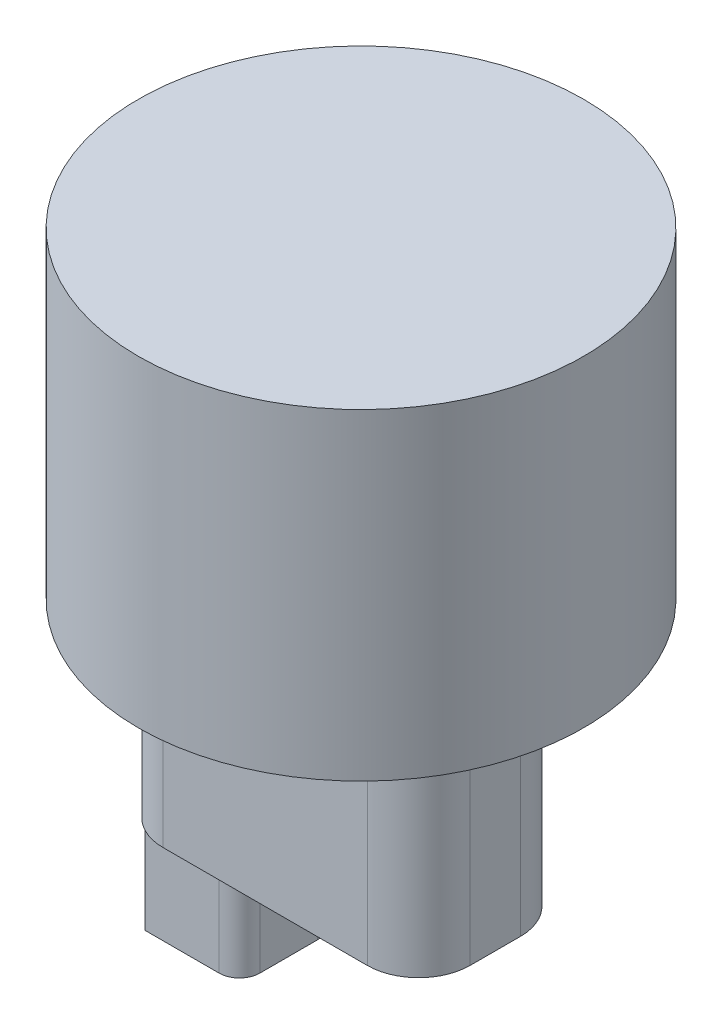
ISO-10303-21;
HEADER;
FILE_DESCRIPTION(('STEP AP214'),'2;1');
FILE_NAME('part.step','',(''),(''),'','','');
FILE_SCHEMA(('AUTOMOTIVE_DESIGN { 1 0 10303 214 1 1 1 1 }'));
ENDSEC;
DATA;
#1=APPLICATION_CONTEXT('core data for automotive mechanical design processes');
#2=APPLICATION_PROTOCOL_DEFINITION('international standard','automotive_design',2000,#1);
#3=PRODUCT_CONTEXT('',#1,'mechanical');
#4=PRODUCT('Part','Part','',(#3));
#5=PRODUCT_RELATED_PRODUCT_CATEGORY('part','',(#4));
#6=PRODUCT_DEFINITION_FORMATION('','',#4);
#7=PRODUCT_DEFINITION_CONTEXT('part definition',#1,'design');
#8=PRODUCT_DEFINITION('design','',#6,#7);
#9=PRODUCT_DEFINITION_SHAPE('','',#8);
#10=(LENGTH_UNIT() NAMED_UNIT(*) SI_UNIT(.MILLI.,.METRE.));
#11=(NAMED_UNIT(*) PLANE_ANGLE_UNIT() SI_UNIT($,.RADIAN.));
#12=(NAMED_UNIT(*) SI_UNIT($,.STERADIAN.) SOLID_ANGLE_UNIT());
#13=UNCERTAINTY_MEASURE_WITH_UNIT(LENGTH_MEASURE(1.E-05),#10,'distance_accuracy_value','');
#14=(GEOMETRIC_REPRESENTATION_CONTEXT(3) GLOBAL_UNCERTAINTY_ASSIGNED_CONTEXT((#13)) GLOBAL_UNIT_ASSIGNED_CONTEXT((#10,
#11,#12)) REPRESENTATION_CONTEXT('',''));
#15=CARTESIAN_POINT('',(0.,0.,0.));
#16=DIRECTION('',(0.,0.,1.));
#17=DIRECTION('',(1.,0.,0.));
#18=AXIS2_PLACEMENT_3D('',#15,#16,#17);
#19=CARTESIAN_POINT('',(-31.6,-61.8,-6.56885426065514));
#20=DIRECTION('',(0.,-1.,0.));
#21=DIRECTION('',(0.,0.,-1.));
#22=AXIS2_PLACEMENT_3D('',#19,#20,#21);
#23=PLANE('',#22);
#24=CARTESIAN_POINT('',(-31.6,-61.8,6.56885426065515));
#25=DIRECTION('',(0.,1.,0.));
#26=DIRECTION('',(0.,0.,-1.));
#27=AXIS2_PLACEMENT_3D('',#24,#25,#26);
#28=CIRCLE('',#27,13.4);
#29=CARTESIAN_POINT('',(-44.526368777329,-61.8,10.1));
#30=VERTEX_POINT('',#29);
#31=CARTESIAN_POINT('',(-43.4630865618963,-61.8,12.8));
#32=VERTEX_POINT('',#31);
#33=EDGE_CURVE('E225',#30,#32,#28,.T.);
#34=ORIENTED_EDGE('',*,*,#33,.F.);
#35=DIRECTION('',(0.366418867951286,0.,0.930450005754903));
#36=VECTOR('',#35,1.);
#37=CARTESIAN_POINT('',(-48.4738249382267,-61.8,0.076196836804784));
#38=LINE('',#37,#36);
#39=EDGE_CURVE('E11',#30,#32,#38,.T.);
#40=ORIENTED_EDGE('',*,*,#39,.T.);
#41=EDGE_LOOP('',(#34,#40));
#42=FACE_BOUND('',#41,.T.);
#43=ADVANCED_FACE('F39',(#42),#23,.T.);
#44=DIRECTION('',(1.,0.,0.));
#45=VECTOR('',#44,1.);
#46=CARTESIAN_POINT('',(-31.6,-61.8,10.1));
#47=LINE('',#46,#45);
#48=CARTESIAN_POINT('',(-24.2524934258124,-61.8,10.1));
#49=VERTEX_POINT('',#48);
#50=EDGE_CURVE('E48',#30,#49,#47,.T.);
#51=ORIENTED_EDGE('',*,*,#50,.F.);
#52=CARTESIAN_POINT('',(-45.,-61.8,6.56885426065507));
#53=VERTEX_POINT('',#52);
#54=EDGE_CURVE('E220',#53,#30,#28,.T.);
#55=ORIENTED_EDGE('',*,*,#54,.F.);
#56=DIRECTION('',(0.,0.,1.));
#57=VECTOR('',#56,1.);
#58=CARTESIAN_POINT('',(-45.,-61.8,6.56885426065507));
#59=LINE('',#58,#57);
#60=CARTESIAN_POINT('',(-45.,-61.8,-6.56885426065504));
#61=VERTEX_POINT('',#60);
#62=EDGE_CURVE('E213',#61,#53,#59,.T.);
#63=ORIENTED_EDGE('',*,*,#62,.F.);
#64=CARTESIAN_POINT('',(-31.6,-61.8,-6.56885426065514));
#65=DIRECTION('',(0.,1.,0.));
#66=DIRECTION('',(0.,0.,-1.));
#67=AXIS2_PLACEMENT_3D('',#64,#65,#66);
#68=CIRCLE('',#67,13.4);
#69=CARTESIAN_POINT('',(-44.526368777329,-61.8,-10.1));
#70=VERTEX_POINT('',#69);
#71=EDGE_CURVE('E215',#70,#61,#68,.T.);
#72=ORIENTED_EDGE('',*,*,#71,.F.);
#73=DIRECTION('',(1.,0.,0.));
#74=VECTOR('',#73,1.);
#75=CARTESIAN_POINT('',(-31.6,-61.8,-10.1));
#76=LINE('',#75,#74);
#77=CARTESIAN_POINT('',(-24.2524934258124,-61.8,-10.1));
#78=VERTEX_POINT('',#77);
#79=EDGE_CURVE('E323',#70,#78,#76,.T.);
#80=ORIENTED_EDGE('',*,*,#79,.T.);
#81=CARTESIAN_POINT('',(-24.2524934258124,-61.8,-7.39999999999999));
#82=DIRECTION('',(0.,-1.,0.));
#83=DIRECTION('',(0.,0.,-1.));
#84=AXIS2_PLACEMENT_3D('',#81,#82,#83);
#85=CIRCLE('',#84,2.7);
#86=CARTESIAN_POINT('',(-21.5524934258124,-61.8,-7.39999999999997));
#87=VERTEX_POINT('',#86);
#88=EDGE_CURVE('E327',#78,#87,#85,.T.);
#89=ORIENTED_EDGE('',*,*,#88,.T.);
#90=DIRECTION('',(0.,0.,1.));
#91=VECTOR('',#90,1.);
#92=CARTESIAN_POINT('',(-21.5524934258124,-61.8,-6.56885426065514));
#93=LINE('',#92,#91);
#94=CARTESIAN_POINT('',(-21.5524934258124,-61.8,7.39999999999998));
#95=VERTEX_POINT('',#94);
#96=EDGE_CURVE('E331',#87,#95,#93,.T.);
#97=ORIENTED_EDGE('',*,*,#96,.T.);
#98=CARTESIAN_POINT('',(-24.2524934258124,-61.8,7.4));
#99=DIRECTION('',(0.,-1.,0.));
#100=DIRECTION('',(0.,0.,-1.));
#101=AXIS2_PLACEMENT_3D('',#98,#99,#100);
#102=CIRCLE('',#101,2.7);
#103=EDGE_CURVE('E335',#49,#95,#102,.F.);
#104=ORIENTED_EDGE('',*,*,#103,.F.);
#105=EDGE_LOOP('',(#51,#55,#63,#72,#80,#89,#97,#104));
#106=FACE_BOUND('',#105,.T.);
#107=ADVANCED_FACE('F355',(#106),#23,.T.);
#108=DIRECTION('',(0.366418867951281,0.,-0.930450005754904));
#109=VECTOR('',#108,1.);
#110=CARTESIAN_POINT('',(-43.9947276696127,-61.8,-11.4499999999999));
#111=LINE('',#110,#109);
#112=CARTESIAN_POINT('',(-43.4630865618963,-61.8,-12.8));
#113=VERTEX_POINT('',#112);
#114=EDGE_CURVE('E320',#70,#113,#111,.T.);
#115=ORIENTED_EDGE('',*,*,#114,.F.);
#116=EDGE_CURVE('E214',#113,#70,#68,.T.);
#117=ORIENTED_EDGE('',*,*,#116,.F.);
#118=EDGE_LOOP('',(#115,#117));
#119=FACE_BOUND('',#118,.T.);
#120=ADVANCED_FACE('F506',(#119),#23,.T.);
#121=CARTESIAN_POINT('',(0.,83.82,0.));
#122=DIRECTION('',(0.,-1.,0.));
#123=DIRECTION('',(0.,0.,-1.));
#124=AXIS2_PLACEMENT_3D('',#121,#122,#123);
#125=CYLINDRICAL_SURFACE('',#124,58.);
#126=CARTESIAN_POINT('',(0.,83.82,0.));
#127=DIRECTION('',(0.,1.,0.));
#128=DIRECTION('',(0.,0.,1.));
#129=AXIS2_PLACEMENT_3D('',#126,#127,#128);
#130=CIRCLE('',#129,58.);
#131=CARTESIAN_POINT('',(0.,83.82,58.));
#132=VERTEX_POINT('',#131);
#133=EDGE_CURVE('E297',#132,#132,#130,.T.);
#134=ORIENTED_EDGE('',*,*,#133,.F.);
#135=EDGE_LOOP('',(#134));
#136=FACE_BOUND('',#135,.T.);
#137=CARTESIAN_POINT('',(0.,0.,0.));
#138=DIRECTION('',(0.,1.,0.));
#139=DIRECTION('',(0.,0.,1.));
#140=AXIS2_PLACEMENT_3D('',#137,#138,#139);
#141=CIRCLE('',#140,58.);
#142=CARTESIAN_POINT('',(0.,0.,58.));
#143=VERTEX_POINT('',#142);
#144=EDGE_CURVE('E275',#143,#143,#141,.T.);
#145=ORIENTED_EDGE('',*,*,#144,.T.);
#146=EDGE_LOOP('',(#145));
#147=FACE_BOUND('',#146,.T.);
#148=ADVANCED_FACE('F41',(#136,#147),#125,.T.);
#149=CARTESIAN_POINT('',(0.,83.82,0.));
#150=DIRECTION('',(0.,1.,0.));
#151=DIRECTION('',(0.,0.,1.));
#152=AXIS2_PLACEMENT_3D('',#149,#150,#151);
#153=PLANE('',#152);
#154=ORIENTED_EDGE('',*,*,#133,.T.);
#155=EDGE_LOOP('',(#154));
#156=FACE_BOUND('',#155,.T.);
#157=ADVANCED_FACE('F520',(#156),#153,.T.);
#158=CARTESIAN_POINT('',(0.,0.,0.));
#159=DIRECTION('',(0.,1.,0.));
#160=DIRECTION('',(0.,0.,1.));
#161=AXIS2_PLACEMENT_3D('',#158,#159,#160);
#162=PLANE('',#161);
#163=DIRECTION('',(-1.,0.,0.));
#164=VECTOR('',#163,1.);
#165=CARTESIAN_POINT('',(-31.5999999999999,0.,-19.9688542606551));
#166=LINE('',#165,#164);
#167=CARTESIAN_POINT('',(21.5999999999999,0.,-19.9688542606551));
#168=VERTEX_POINT('',#167);
#169=CARTESIAN_POINT('',(-31.5999999999999,0.,-19.9688542606551));
#170=VERTEX_POINT('',#169);
#171=EDGE_CURVE('E268',#168,#170,#166,.T.);
#172=ORIENTED_EDGE('',*,*,#171,.T.);
#173=CARTESIAN_POINT('',(-31.6,0.,-6.56885426065514));
#174=DIRECTION('',(0.,1.,0.));
#175=DIRECTION('',(0.,0.,-1.));
#176=AXIS2_PLACEMENT_3D('',#173,#174,#175);
#177=CIRCLE('',#176,13.4);
#178=CARTESIAN_POINT('',(-45.,0.,-6.56885426065504));
#179=VERTEX_POINT('',#178);
#180=EDGE_CURVE('E63',#170,#179,#177,.T.);
#181=ORIENTED_EDGE('',*,*,#180,.T.);
#182=DIRECTION('',(0.,0.,1.));
#183=VECTOR('',#182,1.);
#184=CARTESIAN_POINT('',(-45.,0.,6.56885426065507));
#185=LINE('',#184,#183);
#186=CARTESIAN_POINT('',(-45.,0.,6.56885426065507));
#187=VERTEX_POINT('',#186);
#188=EDGE_CURVE('E203',#179,#187,#185,.T.);
#189=ORIENTED_EDGE('',*,*,#188,.T.);
#190=CARTESIAN_POINT('',(-31.6,0.,6.56885426065515));
#191=DIRECTION('',(0.,1.,0.));
#192=DIRECTION('',(0.,0.,-1.));
#193=AXIS2_PLACEMENT_3D('',#190,#191,#192);
#194=CIRCLE('',#193,13.4);
#195=CARTESIAN_POINT('',(-31.5999999999999,0.,19.9688542606552));
#196=VERTEX_POINT('',#195);
#197=EDGE_CURVE('E249',#187,#196,#194,.T.);
#198=ORIENTED_EDGE('',*,*,#197,.T.);
#199=DIRECTION('',(1.,0.,0.));
#200=VECTOR('',#199,1.);
#201=CARTESIAN_POINT('',(-31.5999999999999,0.,19.9688542606552));
#202=LINE('',#201,#200);
#203=CARTESIAN_POINT('',(21.5999999999999,0.,19.9688542606551));
#204=VERTEX_POINT('',#203);
#205=EDGE_CURVE('E252',#196,#204,#202,.T.);
#206=ORIENTED_EDGE('',*,*,#205,.T.);
#207=CARTESIAN_POINT('',(21.6,0.,6.56885426065514));
#208=DIRECTION('',(0.,1.,0.));
#209=DIRECTION('',(0.,0.,1.));
#210=AXIS2_PLACEMENT_3D('',#207,#208,#209);
#211=CIRCLE('',#210,13.4);
#212=CARTESIAN_POINT('',(35.,0.,6.56885426065505));
#213=VERTEX_POINT('',#212);
#214=EDGE_CURVE('E256',#204,#213,#211,.T.);
#215=ORIENTED_EDGE('',*,*,#214,.T.);
#216=DIRECTION('',(0.,0.,-1.));
#217=VECTOR('',#216,1.);
#218=CARTESIAN_POINT('',(35.,0.,-6.56885426065504));
#219=LINE('',#218,#217);
#220=CARTESIAN_POINT('',(35.,0.,-6.56885426065504));
#221=VERTEX_POINT('',#220);
#222=EDGE_CURVE('E260',#213,#221,#219,.T.);
#223=ORIENTED_EDGE('',*,*,#222,.T.);
#224=CARTESIAN_POINT('',(21.6,0.,-6.56885426065514));
#225=DIRECTION('',(0.,1.,0.));
#226=DIRECTION('',(0.,0.,-1.));
#227=AXIS2_PLACEMENT_3D('',#224,#225,#226);
#228=CIRCLE('',#227,13.4);
#229=EDGE_CURVE('E264',#221,#168,#228,.T.);
#230=ORIENTED_EDGE('',*,*,#229,.T.);
#231=EDGE_LOOP('',(#172,#181,#189,#198,#206,#215,#223,#230));
#232=FACE_BOUND('',#231,.T.);
#233=ORIENTED_EDGE('',*,*,#144,.F.);
#234=EDGE_LOOP('',(#233));
#235=FACE_BOUND('',#234,.T.);
#236=ADVANCED_FACE('F474',(#232,#235),#162,.F.);
#237=CARTESIAN_POINT('',(-31.6,-61.8,-6.56885426065514));
#238=DIRECTION('',(0.,1.,0.));
#239=DIRECTION('',(0.,0.,1.));
#240=AXIS2_PLACEMENT_3D('',#237,#238,#239);
#241=CYLINDRICAL_SURFACE('',#240,13.4);
#242=CARTESIAN_POINT('',(-31.5999999999999,-61.8,-19.9688542606551));
#243=VERTEX_POINT('',#242);
#244=EDGE_CURVE('E209',#243,#113,#68,.T.);
#245=ORIENTED_EDGE('',*,*,#244,.T.);
#246=ORIENTED_EDGE('',*,*,#116,.T.);
#247=ORIENTED_EDGE('',*,*,#71,.T.);
#248=DIRECTION('',(0.,1.,0.));
#249=VECTOR('',#248,1.);
#250=CARTESIAN_POINT('',(-45.,-61.8,-6.56885426065504));
#251=LINE('',#250,#249);
#252=EDGE_CURVE('E244',#61,#179,#251,.T.);
#253=ORIENTED_EDGE('',*,*,#252,.T.);
#254=ORIENTED_EDGE('',*,*,#180,.F.);
#255=DIRECTION('',(0.,1.,0.));
#256=VECTOR('',#255,1.);
#257=CARTESIAN_POINT('',(-31.5999999999999,-61.8,-19.9688542606551));
#258=LINE('',#257,#256);
#259=EDGE_CURVE('E272',#243,#170,#258,.T.);
#260=ORIENTED_EDGE('',*,*,#259,.F.);
#261=EDGE_LOOP('',(#245,#246,#247,#253,#254,#260));
#262=FACE_BOUND('',#261,.T.);
#263=ADVANCED_FACE('F467',(#262),#241,.T.);
#264=CARTESIAN_POINT('',(-31.5999999999999,-61.8,-19.9688542606551));
#265=DIRECTION('',(0.,0.,-1.));
#266=DIRECTION('',(-1.,0.,0.));
#267=AXIS2_PLACEMENT_3D('',#264,#265,#266);
#268=PLANE('',#267);
#269=ORIENTED_EDGE('',*,*,#171,.F.);
#270=DIRECTION('',(0.,1.,0.));
#271=VECTOR('',#270,1.);
#272=CARTESIAN_POINT('',(21.5999999999999,-61.8,-19.9688542606551));
#273=LINE('',#272,#271);
#274=CARTESIAN_POINT('',(21.5999999999999,-61.8,-19.9688542606551));
#275=VERTEX_POINT('',#274);
#276=EDGE_CURVE('E276',#275,#168,#273,.T.);
#277=ORIENTED_EDGE('',*,*,#276,.F.);
#278=DIRECTION('',(-1.,0.,0.));
#279=VECTOR('',#278,1.);
#280=CARTESIAN_POINT('',(-31.5999999999999,-61.8,-19.9688542606551));
#281=LINE('',#280,#279);
#282=EDGE_CURVE('E241',#275,#243,#281,.T.);
#283=ORIENTED_EDGE('',*,*,#282,.T.);
#284=ORIENTED_EDGE('',*,*,#259,.T.);
#285=EDGE_LOOP('',(#269,#277,#283,#284));
#286=FACE_BOUND('',#285,.T.);
#287=ADVANCED_FACE('F479',(#286),#268,.T.);
#288=CARTESIAN_POINT('',(21.6,-61.8,-6.56885426065514));
#289=DIRECTION('',(0.,1.,0.));
#290=DIRECTION('',(0.,0.,1.));
#291=AXIS2_PLACEMENT_3D('',#288,#289,#290);
#292=CYLINDRICAL_SURFACE('',#291,13.4);
#293=ORIENTED_EDGE('',*,*,#229,.F.);
#294=DIRECTION('',(0.,1.,0.));
#295=VECTOR('',#294,1.);
#296=CARTESIAN_POINT('',(35.,-61.8,-6.56885426065504));
#297=LINE('',#296,#295);
#298=CARTESIAN_POINT('',(35.,-61.8,-6.56885426065504));
#299=VERTEX_POINT('',#298);
#300=EDGE_CURVE('E279',#299,#221,#297,.T.);
#301=ORIENTED_EDGE('',*,*,#300,.F.);
#302=CARTESIAN_POINT('',(21.6,-61.8,-6.56885426065514));
#303=DIRECTION('',(0.,1.,0.));
#304=DIRECTION('',(0.,0.,-1.));
#305=AXIS2_PLACEMENT_3D('',#302,#303,#304);
#306=CIRCLE('',#305,13.4);
#307=EDGE_CURVE('E237',#299,#275,#306,.T.);
#308=ORIENTED_EDGE('',*,*,#307,.T.);
#309=ORIENTED_EDGE('',*,*,#276,.T.);
#310=EDGE_LOOP('',(#293,#301,#308,#309));
#311=FACE_BOUND('',#310,.T.);
#312=ADVANCED_FACE('F538',(#311),#292,.T.);
#313=CARTESIAN_POINT('',(35.,-61.8,-6.56885426065504));
#314=DIRECTION('',(1.,0.,0.));
#315=DIRECTION('',(0.,0.,-1.));
#316=AXIS2_PLACEMENT_3D('',#313,#314,#315);
#317=PLANE('',#316);
#318=ORIENTED_EDGE('',*,*,#222,.F.);
#319=DIRECTION('',(0.,1.,0.));
#320=VECTOR('',#319,1.);
#321=CARTESIAN_POINT('',(35.,-61.8,6.56885426065505));
#322=LINE('',#321,#320);
#323=CARTESIAN_POINT('',(35.,-61.8,6.56885426065505));
#324=VERTEX_POINT('',#323);
#325=EDGE_CURVE('E282',#324,#213,#322,.T.);
#326=ORIENTED_EDGE('',*,*,#325,.F.);
#327=DIRECTION('',(0.,0.,-1.));
#328=VECTOR('',#327,1.);
#329=CARTESIAN_POINT('',(35.,-61.8,-6.56885426065504));
#330=LINE('',#329,#328);
#331=EDGE_CURVE('E233',#324,#299,#330,.T.);
#332=ORIENTED_EDGE('',*,*,#331,.T.);
#333=ORIENTED_EDGE('',*,*,#300,.T.);
#334=EDGE_LOOP('',(#318,#326,#332,#333));
#335=FACE_BOUND('',#334,.T.);
#336=ADVANCED_FACE('F486',(#335),#317,.T.);
#337=CARTESIAN_POINT('',(21.6,-61.8,6.56885426065514));
#338=DIRECTION('',(0.,1.,0.));
#339=DIRECTION('',(0.,0.,1.));
#340=AXIS2_PLACEMENT_3D('',#337,#338,#339);
#341=CYLINDRICAL_SURFACE('',#340,13.4);
#342=ORIENTED_EDGE('',*,*,#214,.F.);
#343=DIRECTION('',(0.,1.,0.));
#344=VECTOR('',#343,1.);
#345=CARTESIAN_POINT('',(21.5999999999999,-61.8,19.9688542606551));
#346=LINE('',#345,#344);
#347=CARTESIAN_POINT('',(21.5999999999999,-61.8,19.9688542606551));
#348=VERTEX_POINT('',#347);
#349=EDGE_CURVE('E285',#348,#204,#346,.T.);
#350=ORIENTED_EDGE('',*,*,#349,.F.);
#351=CARTESIAN_POINT('',(21.6,-61.8,6.56885426065514));
#352=DIRECTION('',(0.,1.,0.));
#353=DIRECTION('',(0.,0.,1.));
#354=AXIS2_PLACEMENT_3D('',#351,#352,#353);
#355=CIRCLE('',#354,13.4);
#356=EDGE_CURVE('E229',#348,#324,#355,.T.);
#357=ORIENTED_EDGE('',*,*,#356,.T.);
#358=ORIENTED_EDGE('',*,*,#325,.T.);
#359=EDGE_LOOP('',(#342,#350,#357,#358));
#360=FACE_BOUND('',#359,.T.);
#361=ADVANCED_FACE('F489',(#360),#341,.T.);
#362=CARTESIAN_POINT('',(-31.5999999999999,-61.8,19.9688542606552));
#363=DIRECTION('',(0.,0.,1.));
#364=DIRECTION('',(1.,0.,0.));
#365=AXIS2_PLACEMENT_3D('',#362,#363,#364);
#366=PLANE('',#365);
#367=ORIENTED_EDGE('',*,*,#205,.F.);
#368=DIRECTION('',(0.,1.,0.));
#369=VECTOR('',#368,1.);
#370=CARTESIAN_POINT('',(-31.5999999999999,-61.8,19.9688542606552));
#371=LINE('',#370,#369);
#372=CARTESIAN_POINT('',(-31.5999999999999,-61.8,19.9688542606552));
#373=VERTEX_POINT('',#372);
#374=EDGE_CURVE('E288',#373,#196,#371,.T.);
#375=ORIENTED_EDGE('',*,*,#374,.F.);
#376=DIRECTION('',(1.,0.,0.));
#377=VECTOR('',#376,1.);
#378=CARTESIAN_POINT('',(-31.5999999999999,-61.8,19.9688542606552));
#379=LINE('',#378,#377);
#380=EDGE_CURVE('E224',#373,#348,#379,.T.);
#381=ORIENTED_EDGE('',*,*,#380,.T.);
#382=ORIENTED_EDGE('',*,*,#349,.T.);
#383=EDGE_LOOP('',(#367,#375,#381,#382));
#384=FACE_BOUND('',#383,.T.);
#385=ADVANCED_FACE('F492',(#384),#366,.T.);
#386=CARTESIAN_POINT('',(-31.6,-61.8,6.56885426065515));
#387=DIRECTION('',(0.,1.,0.));
#388=DIRECTION('',(0.,0.,1.));
#389=AXIS2_PLACEMENT_3D('',#386,#387,#388);
#390=CYLINDRICAL_SURFACE('',#389,13.4);
#391=ORIENTED_EDGE('',*,*,#54,.T.);
#392=ORIENTED_EDGE('',*,*,#33,.T.);
#393=EDGE_CURVE('E219',#32,#373,#28,.T.);
#394=ORIENTED_EDGE('',*,*,#393,.T.);
#395=ORIENTED_EDGE('',*,*,#374,.T.);
#396=ORIENTED_EDGE('',*,*,#197,.F.);
#397=DIRECTION('',(0.,1.,0.));
#398=VECTOR('',#397,1.);
#399=CARTESIAN_POINT('',(-45.,-61.8,6.56885426065507));
#400=LINE('',#399,#398);
#401=EDGE_CURVE('E292',#53,#187,#400,.T.);
#402=ORIENTED_EDGE('',*,*,#401,.F.);
#403=EDGE_LOOP('',(#391,#392,#394,#395,#396,#402));
#404=FACE_BOUND('',#403,.T.);
#405=ADVANCED_FACE('F459',(#404),#390,.T.);
#406=CARTESIAN_POINT('',(-45.,-61.8,6.56885426065507));
#407=DIRECTION('',(-1.,0.,0.));
#408=DIRECTION('',(0.,0.,1.));
#409=AXIS2_PLACEMENT_3D('',#406,#407,#408);
#410=PLANE('',#409);
#411=ORIENTED_EDGE('',*,*,#188,.F.);
#412=ORIENTED_EDGE('',*,*,#252,.F.);
#413=ORIENTED_EDGE('',*,*,#62,.T.);
#414=ORIENTED_EDGE('',*,*,#401,.T.);
#415=EDGE_LOOP('',(#411,#412,#413,#414));
#416=FACE_BOUND('',#415,.T.);
#417=ADVANCED_FACE('F471',(#416),#410,.T.);
#418=DIRECTION('',(1.,0.,0.));
#419=VECTOR('',#418,1.);
#420=CARTESIAN_POINT('',(-31.6,-61.8,-12.8));
#421=LINE('',#420,#419);
#422=CARTESIAN_POINT('',(-24.1524934258125,-61.8,-12.8));
#423=VERTEX_POINT('',#422);
#424=EDGE_CURVE('E317',#113,#423,#421,.T.);
#425=ORIENTED_EDGE('',*,*,#424,.F.);
#426=ORIENTED_EDGE('',*,*,#244,.F.);
#427=ORIENTED_EDGE('',*,*,#282,.F.);
#428=ORIENTED_EDGE('',*,*,#307,.F.);
#429=ORIENTED_EDGE('',*,*,#331,.F.);
#430=ORIENTED_EDGE('',*,*,#356,.F.);
#431=ORIENTED_EDGE('',*,*,#380,.F.);
#432=ORIENTED_EDGE('',*,*,#393,.F.);
#433=DIRECTION('',(1.,0.,0.));
#434=VECTOR('',#433,1.);
#435=CARTESIAN_POINT('',(-31.6,-61.8,12.8));
#436=LINE('',#435,#434);
#437=CARTESIAN_POINT('',(-24.1524934258124,-61.8,12.8));
#438=VERTEX_POINT('',#437);
#439=EDGE_CURVE('E198',#32,#438,#436,.T.);
#440=ORIENTED_EDGE('',*,*,#439,.T.);
#441=CARTESIAN_POINT('',(-24.1524934258124,-61.8,7.5));
#442=DIRECTION('',(0.,-1.,0.));
#443=DIRECTION('',(0.,0.,-1.));
#444=AXIS2_PLACEMENT_3D('',#441,#442,#443);
#445=CIRCLE('',#444,5.3);
#446=CARTESIAN_POINT('',(-18.8524934258124,-61.8,7.49999999999996));
#447=VERTEX_POINT('',#446);
#448=EDGE_CURVE('E306',#438,#447,#445,.F.);
#449=ORIENTED_EDGE('',*,*,#448,.T.);
#450=DIRECTION('',(0.,0.,-1.));
#451=VECTOR('',#450,1.);
#452=CARTESIAN_POINT('',(-18.8524934258124,-61.8,-6.56885426065515));
#453=LINE('',#452,#451);
#454=CARTESIAN_POINT('',(-18.8524934258124,-61.8,-7.49999999999996));
#455=VERTEX_POINT('',#454);
#456=EDGE_CURVE('E310',#447,#455,#453,.T.);
#457=ORIENTED_EDGE('',*,*,#456,.T.);
#458=CARTESIAN_POINT('',(-24.1524934258124,-61.8,-7.49999999999999));
#459=DIRECTION('',(0.,-1.,0.));
#460=DIRECTION('',(0.,0.,-1.));
#461=AXIS2_PLACEMENT_3D('',#458,#459,#460);
#462=CIRCLE('',#461,5.3);
#463=EDGE_CURVE('E314',#423,#455,#462,.T.);
#464=ORIENTED_EDGE('',*,*,#463,.F.);
#465=EDGE_LOOP('',(#425,#426,#427,#428,#429,#430,#431,#432,#440,#449,#457,#464));
#466=FACE_BOUND('',#465,.T.);
#467=ADVANCED_FACE('F443',(#466),#23,.T.);
#468=CARTESIAN_POINT('',(-43.4630865618963,-90.,12.8));
#469=DIRECTION('',(0.930450005754903,0.,-0.366418867951286));
#470=DIRECTION('',(-0.366418867951286,0.,-0.930450005754903));
#471=AXIS2_PLACEMENT_3D('',#468,#469,#470);
#472=PLANE('',#471);
#473=ORIENTED_EDGE('',*,*,#39,.F.);
#474=DIRECTION('',(0.,1.,0.));
#475=VECTOR('',#474,1.);
#476=CARTESIAN_POINT('',(-44.526368777329,-90.,10.1));
#477=LINE('',#476,#475);
#478=CARTESIAN_POINT('',(-44.526368777329,-90.,10.1));
#479=VERTEX_POINT('',#478);
#480=EDGE_CURVE('E183',#479,#30,#477,.T.);
#481=ORIENTED_EDGE('',*,*,#480,.F.);
#482=DIRECTION('',(-0.366418867951286,0.,-0.930450005754903));
#483=VECTOR('',#482,1.);
#484=CARTESIAN_POINT('',(-43.4630865618963,-90.,12.8));
#485=LINE('',#484,#483);
#486=CARTESIAN_POINT('',(-43.4630865618963,-90.,12.8));
#487=VERTEX_POINT('',#486);
#488=EDGE_CURVE('E177',#487,#479,#485,.T.);
#489=ORIENTED_EDGE('',*,*,#488,.F.);
#490=DIRECTION('',(0.,1.,0.));
#491=VECTOR('',#490,1.);
#492=CARTESIAN_POINT('',(-43.4630865618963,-90.,12.8));
#493=LINE('',#492,#491);
#494=EDGE_CURVE('E181',#487,#32,#493,.T.);
#495=ORIENTED_EDGE('',*,*,#494,.T.);
#496=EDGE_LOOP('',(#473,#481,#489,#495));
#497=FACE_BOUND('',#496,.T.);
#498=ADVANCED_FACE('F179',(#497),#472,.F.);
#499=CARTESIAN_POINT('',(-24.2524934258124,-90.,10.1));
#500=DIRECTION('',(0.,0.,-1.));
#501=DIRECTION('',(-1.,0.,0.));
#502=AXIS2_PLACEMENT_3D('',#499,#500,#501);
#503=PLANE('',#502);
#504=ORIENTED_EDGE('',*,*,#480,.T.);
#505=ORIENTED_EDGE('',*,*,#50,.T.);
#506=DIRECTION('',(0.,1.,0.));
#507=VECTOR('',#506,1.);
#508=CARTESIAN_POINT('',(-24.2524934258124,-90.,10.1));
#509=LINE('',#508,#507);
#510=CARTESIAN_POINT('',(-24.2524934258124,-90.,10.1));
#511=VERTEX_POINT('',#510);
#512=EDGE_CURVE('E205',#511,#49,#509,.T.);
#513=ORIENTED_EDGE('',*,*,#512,.F.);
#514=DIRECTION('',(-1.,0.,0.));
#515=VECTOR('',#514,1.);
#516=CARTESIAN_POINT('',(-26.8524934258124,-90.,10.1));
#517=LINE('',#516,#515);
#518=EDGE_CURVE('E187',#511,#479,#517,.T.);
#519=ORIENTED_EDGE('',*,*,#518,.T.);
#520=EDGE_LOOP('',(#504,#505,#513,#519));
#521=FACE_BOUND('',#520,.T.);
#522=ADVANCED_FACE('F342',(#521),#503,.T.);
#523=CARTESIAN_POINT('',(-24.2524934258124,-90.,7.4));
#524=DIRECTION('',(0.,1.,0.));
#525=DIRECTION('',(0.,0.,1.));
#526=AXIS2_PLACEMENT_3D('',#523,#524,#525);
#527=CYLINDRICAL_SURFACE('',#526,2.7);
#528=ORIENTED_EDGE('',*,*,#512,.T.);
#529=ORIENTED_EDGE('',*,*,#103,.T.);
#530=DIRECTION('',(0.,1.,0.));
#531=VECTOR('',#530,1.);
#532=CARTESIAN_POINT('',(-21.5524934258124,-90.,7.39999999999998));
#533=LINE('',#532,#531);
#534=CARTESIAN_POINT('',(-21.5524934258124,-90.,7.39999999999998));
#535=VERTEX_POINT('',#534);
#536=EDGE_CURVE('E354',#535,#95,#533,.T.);
#537=ORIENTED_EDGE('',*,*,#536,.F.);
#538=CARTESIAN_POINT('',(-24.2524934258124,-90.,7.4));
#539=DIRECTION('',(0.,-1.,0.));
#540=DIRECTION('',(0.,0.,-1.));
#541=AXIS2_PLACEMENT_3D('',#538,#539,#540);
#542=CIRCLE('',#541,2.7);
#543=EDGE_CURVE('E352',#535,#511,#542,.T.);
#544=ORIENTED_EDGE('',*,*,#543,.T.);
#545=EDGE_LOOP('',(#528,#529,#537,#544));
#546=FACE_BOUND('',#545,.T.);
#547=ADVANCED_FACE('F349',(#546),#527,.F.);
#548=CARTESIAN_POINT('',(-21.5524934258124,-90.,-4.79999999999999));
#549=DIRECTION('',(1.,0.,0.));
#550=DIRECTION('',(0.,0.,-1.));
#551=AXIS2_PLACEMENT_3D('',#548,#549,#550);
#552=PLANE('',#551);
#553=ORIENTED_EDGE('',*,*,#96,.F.);
#554=DIRECTION('',(0.,1.,0.));
#555=VECTOR('',#554,1.);
#556=CARTESIAN_POINT('',(-21.5524934258124,-90.,-7.39999999999997));
#557=LINE('',#556,#555);
#558=CARTESIAN_POINT('',(-21.5524934258124,-90.,-7.39999999999997));
#559=VERTEX_POINT('',#558);
#560=EDGE_CURVE('E361',#559,#87,#557,.T.);
#561=ORIENTED_EDGE('',*,*,#560,.F.);
#562=DIRECTION('',(0.,0.,1.));
#563=VECTOR('',#562,1.);
#564=CARTESIAN_POINT('',(-21.5524934258124,-90.,4.8));
#565=LINE('',#564,#563);
#566=EDGE_CURVE('E420',#559,#535,#565,.T.);
#567=ORIENTED_EDGE('',*,*,#566,.T.);
#568=ORIENTED_EDGE('',*,*,#536,.T.);
#569=EDGE_LOOP('',(#553,#561,#567,#568));
#570=FACE_BOUND('',#569,.T.);
#571=ADVANCED_FACE('F359',(#570),#552,.F.);
#572=CARTESIAN_POINT('',(-24.2524934258124,-90.,-7.39999999999999));
#573=DIRECTION('',(0.,1.,0.));
#574=DIRECTION('',(0.,0.,1.));
#575=AXIS2_PLACEMENT_3D('',#572,#573,#574);
#576=CYLINDRICAL_SURFACE('',#575,2.7);
#577=ORIENTED_EDGE('',*,*,#88,.F.);
#578=DIRECTION('',(0.,1.,0.));
#579=VECTOR('',#578,1.);
#580=CARTESIAN_POINT('',(-24.2524934258124,-90.,-10.1));
#581=LINE('',#580,#579);
#582=CARTESIAN_POINT('',(-24.2524934258124,-90.,-10.1));
#583=VERTEX_POINT('',#582);
#584=EDGE_CURVE('E369',#583,#78,#581,.T.);
#585=ORIENTED_EDGE('',*,*,#584,.F.);
#586=CARTESIAN_POINT('',(-24.2524934258124,-90.,-7.39999999999999));
#587=DIRECTION('',(0.,1.,0.));
#588=DIRECTION('',(0.,0.,1.));
#589=AXIS2_PLACEMENT_3D('',#586,#587,#588);
#590=CIRCLE('',#589,2.7);
#591=EDGE_CURVE('E367',#559,#583,#590,.T.);
#592=ORIENTED_EDGE('',*,*,#591,.F.);
#593=ORIENTED_EDGE('',*,*,#560,.T.);
#594=EDGE_LOOP('',(#577,#585,#592,#593));
#595=FACE_BOUND('',#594,.T.);
#596=ADVANCED_FACE('F364',(#595),#576,.F.);
#597=CARTESIAN_POINT('',(-26.8524934258124,-90.,-10.1));
#598=DIRECTION('',(0.,0.,-1.));
#599=DIRECTION('',(-1.,0.,0.));
#600=AXIS2_PLACEMENT_3D('',#597,#598,#599);
#601=PLANE('',#600);
#602=ORIENTED_EDGE('',*,*,#79,.F.);
#603=DIRECTION('',(0.,1.,0.));
#604=VECTOR('',#603,1.);
#605=CARTESIAN_POINT('',(-44.526368777329,-90.,-10.1));
#606=LINE('',#605,#604);
#607=CARTESIAN_POINT('',(-44.526368777329,-90.,-10.1));
#608=VERTEX_POINT('',#607);
#609=EDGE_CURVE('E374',#608,#70,#606,.T.);
#610=ORIENTED_EDGE('',*,*,#609,.F.);
#611=DIRECTION('',(-1.,0.,0.));
#612=VECTOR('',#611,1.);
#613=CARTESIAN_POINT('',(-24.2524934258124,-90.,-10.1));
#614=LINE('',#613,#612);
#615=EDGE_CURVE('E415',#583,#608,#614,.T.);
#616=ORIENTED_EDGE('',*,*,#615,.F.);
#617=ORIENTED_EDGE('',*,*,#584,.T.);
#618=EDGE_LOOP('',(#602,#610,#616,#617));
#619=FACE_BOUND('',#618,.T.);
#620=ADVANCED_FACE('F430',(#619),#601,.F.);
#621=CARTESIAN_POINT('',(-43.4630865618963,-90.,-12.8));
#622=DIRECTION('',(-0.930450005754904,0.,-0.366418867951281));
#623=DIRECTION('',(-0.366418867951281,0.,0.930450005754904));
#624=AXIS2_PLACEMENT_3D('',#621,#622,#623);
#625=PLANE('',#624);
#626=ORIENTED_EDGE('',*,*,#609,.T.);
#627=ORIENTED_EDGE('',*,*,#114,.T.);
#628=DIRECTION('',(0.,1.,0.));
#629=VECTOR('',#628,1.);
#630=CARTESIAN_POINT('',(-43.4630865618963,-90.,-12.8));
#631=LINE('',#630,#629);
#632=CARTESIAN_POINT('',(-43.4630865618963,-90.,-12.8));
#633=VERTEX_POINT('',#632);
#634=EDGE_CURVE('E380',#633,#113,#631,.T.);
#635=ORIENTED_EDGE('',*,*,#634,.F.);
#636=DIRECTION('',(-0.366418867951281,0.,0.930450005754904));
#637=VECTOR('',#636,1.);
#638=CARTESIAN_POINT('',(-43.4630865618963,-90.,-12.8));
#639=LINE('',#638,#637);
#640=EDGE_CURVE('E411',#633,#608,#639,.T.);
#641=ORIENTED_EDGE('',*,*,#640,.T.);
#642=EDGE_LOOP('',(#626,#627,#635,#641));
#643=FACE_BOUND('',#642,.T.);
#644=ADVANCED_FACE('F433',(#643),#625,.T.);
#645=CARTESIAN_POINT('',(-24.1524934258125,-90.,-12.8));
#646=DIRECTION('',(0.,0.,-1.));
#647=DIRECTION('',(-1.,0.,0.));
#648=AXIS2_PLACEMENT_3D('',#645,#646,#647);
#649=PLANE('',#648);
#650=ORIENTED_EDGE('',*,*,#634,.T.);
#651=ORIENTED_EDGE('',*,*,#424,.T.);
#652=DIRECTION('',(0.,1.,0.));
#653=VECTOR('',#652,1.);
#654=CARTESIAN_POINT('',(-24.1524934258125,-90.,-12.8));
#655=LINE('',#654,#653);
#656=CARTESIAN_POINT('',(-24.1524934258125,-90.,-12.8));
#657=VERTEX_POINT('',#656);
#658=EDGE_CURVE('E384',#657,#423,#655,.T.);
#659=ORIENTED_EDGE('',*,*,#658,.F.);
#660=DIRECTION('',(-1.,0.,0.));
#661=VECTOR('',#660,1.);
#662=CARTESIAN_POINT('',(-24.1524934258125,-90.,-12.8));
#663=LINE('',#662,#661);
#664=EDGE_CURVE('E407',#657,#633,#663,.T.);
#665=ORIENTED_EDGE('',*,*,#664,.T.);
#666=EDGE_LOOP('',(#650,#651,#659,#665));
#667=FACE_BOUND('',#666,.T.);
#668=ADVANCED_FACE('F437',(#667),#649,.T.);
#669=CARTESIAN_POINT('',(-24.1524934258124,-90.,-7.49999999999999));
#670=DIRECTION('',(0.,1.,0.));
#671=DIRECTION('',(0.,0.,1.));
#672=AXIS2_PLACEMENT_3D('',#669,#670,#671);
#673=CYLINDRICAL_SURFACE('',#672,5.3);
#674=ORIENTED_EDGE('',*,*,#658,.T.);
#675=ORIENTED_EDGE('',*,*,#463,.T.);
#676=DIRECTION('',(0.,1.,0.));
#677=VECTOR('',#676,1.);
#678=CARTESIAN_POINT('',(-18.8524934258124,-90.,-7.49999999999996));
#679=LINE('',#678,#677);
#680=CARTESIAN_POINT('',(-18.8524934258124,-90.,-7.49999999999996));
#681=VERTEX_POINT('',#680);
#682=EDGE_CURVE('E388',#681,#455,#679,.T.);
#683=ORIENTED_EDGE('',*,*,#682,.F.);
#684=CARTESIAN_POINT('',(-24.1524934258124,-90.,-7.49999999999999));
#685=DIRECTION('',(0.,1.,0.));
#686=DIRECTION('',(0.,0.,1.));
#687=AXIS2_PLACEMENT_3D('',#684,#685,#686);
#688=CIRCLE('',#687,5.3);
#689=EDGE_CURVE('E403',#681,#657,#688,.T.);
#690=ORIENTED_EDGE('',*,*,#689,.T.);
#691=EDGE_LOOP('',(#674,#675,#683,#690));
#692=FACE_BOUND('',#691,.T.);
#693=ADVANCED_FACE('F441',(#692),#673,.T.);
#694=CARTESIAN_POINT('',(-18.8524934258124,-90.,-7.49999999999996));
#695=DIRECTION('',(-1.,0.,0.));
#696=DIRECTION('',(0.,0.,1.));
#697=AXIS2_PLACEMENT_3D('',#694,#695,#696);
#698=PLANE('',#697);
#699=ORIENTED_EDGE('',*,*,#456,.F.);
#700=DIRECTION('',(0.,1.,0.));
#701=VECTOR('',#700,1.);
#702=CARTESIAN_POINT('',(-18.8524934258124,-90.,7.49999999999996));
#703=LINE('',#702,#701);
#704=CARTESIAN_POINT('',(-18.8524934258124,-90.,7.49999999999996));
#705=VERTEX_POINT('',#704);
#706=EDGE_CURVE('E392',#705,#447,#703,.T.);
#707=ORIENTED_EDGE('',*,*,#706,.F.);
#708=DIRECTION('',(0.,0.,1.));
#709=VECTOR('',#708,1.);
#710=CARTESIAN_POINT('',(-18.8524934258124,-90.,-7.49999999999996));
#711=LINE('',#710,#709);
#712=EDGE_CURVE('E400',#681,#705,#711,.T.);
#713=ORIENTED_EDGE('',*,*,#712,.F.);
#714=ORIENTED_EDGE('',*,*,#682,.T.);
#715=EDGE_LOOP('',(#699,#707,#713,#714));
#716=FACE_BOUND('',#715,.T.);
#717=ADVANCED_FACE('F448',(#716),#698,.F.);
#718=CARTESIAN_POINT('',(-24.1524934258124,-90.,7.5));
#719=DIRECTION('',(0.,1.,0.));
#720=DIRECTION('',(0.,0.,1.));
#721=AXIS2_PLACEMENT_3D('',#718,#719,#720);
#722=CYLINDRICAL_SURFACE('',#721,5.3);
#723=ORIENTED_EDGE('',*,*,#448,.F.);
#724=DIRECTION('',(0.,1.,0.));
#725=VECTOR('',#724,1.);
#726=CARTESIAN_POINT('',(-24.1524934258124,-90.,12.8));
#727=LINE('',#726,#725);
#728=CARTESIAN_POINT('',(-24.1524934258124,-90.,12.8));
#729=VERTEX_POINT('',#728);
#730=EDGE_CURVE('E55',#729,#438,#727,.T.);
#731=ORIENTED_EDGE('',*,*,#730,.F.);
#732=CARTESIAN_POINT('',(-24.1524934258124,-90.,7.5));
#733=DIRECTION('',(0.,-1.,0.));
#734=DIRECTION('',(0.,0.,-1.));
#735=AXIS2_PLACEMENT_3D('',#732,#733,#734);
#736=CIRCLE('',#735,5.3);
#737=EDGE_CURVE('E193',#705,#729,#736,.T.);
#738=ORIENTED_EDGE('',*,*,#737,.F.);
#739=ORIENTED_EDGE('',*,*,#706,.T.);
#740=EDGE_LOOP('',(#723,#731,#738,#739));
#741=FACE_BOUND('',#740,.T.);
#742=ADVANCED_FACE('F451',(#741),#722,.T.);
#743=CARTESIAN_POINT('',(-24.1524934258124,-90.,12.8));
#744=DIRECTION('',(0.,0.,-1.));
#745=DIRECTION('',(-1.,0.,0.));
#746=AXIS2_PLACEMENT_3D('',#743,#744,#745);
#747=PLANE('',#746);
#748=ORIENTED_EDGE('',*,*,#439,.F.);
#749=ORIENTED_EDGE('',*,*,#494,.F.);
#750=DIRECTION('',(-1.,0.,0.));
#751=VECTOR('',#750,1.);
#752=CARTESIAN_POINT('',(-40.1892321957995,-90.,12.8));
#753=LINE('',#752,#751);
#754=EDGE_CURVE('E188',#729,#487,#753,.T.);
#755=ORIENTED_EDGE('',*,*,#754,.F.);
#756=ORIENTED_EDGE('',*,*,#730,.T.);
#757=EDGE_LOOP('',(#748,#749,#755,#756));
#758=FACE_BOUND('',#757,.T.);
#759=ADVANCED_FACE('F196',(#758),#747,.F.);
#760=CARTESIAN_POINT('',(-24.2524934258124,-90.,7.4));
#761=DIRECTION('',(0.,-1.,0.));
#762=DIRECTION('',(0.,0.,-1.));
#763=AXIS2_PLACEMENT_3D('',#760,#761,#762);
#764=PLANE('',#763);
#765=ORIENTED_EDGE('',*,*,#754,.T.);
#766=ORIENTED_EDGE('',*,*,#488,.T.);
#767=ORIENTED_EDGE('',*,*,#518,.F.);
#768=ORIENTED_EDGE('',*,*,#543,.F.);
#769=ORIENTED_EDGE('',*,*,#566,.F.);
#770=ORIENTED_EDGE('',*,*,#591,.T.);
#771=ORIENTED_EDGE('',*,*,#615,.T.);
#772=ORIENTED_EDGE('',*,*,#640,.F.);
#773=ORIENTED_EDGE('',*,*,#664,.F.);
#774=ORIENTED_EDGE('',*,*,#689,.F.);
#775=ORIENTED_EDGE('',*,*,#712,.T.);
#776=ORIENTED_EDGE('',*,*,#737,.T.);
#777=EDGE_LOOP('',(#765,#766,#767,#768,#769,#770,#771,#772,#773,#774,#775,#776));
#778=FACE_BOUND('',#777,.T.);
#779=ADVANCED_FACE('F191',(#778),#764,.T.);
#780=CLOSED_SHELL('',(#43,#107,#120,#148,#157,#236,#263,#287,#312,#336,#361,#385,#405,#417,#467,
#498,#522,#547,#571,#596,#620,#644,#668,#693,#717,#742,#759,#779));
#781=MANIFOLD_SOLID_BREP('B2',#780);
#782=ADVANCED_BREP_SHAPE_REPRESENTATION('',(#18,#781),#14);
#783=SHAPE_DEFINITION_REPRESENTATION(#9,#782);
ENDSEC;
END-ISO-10303-21;
